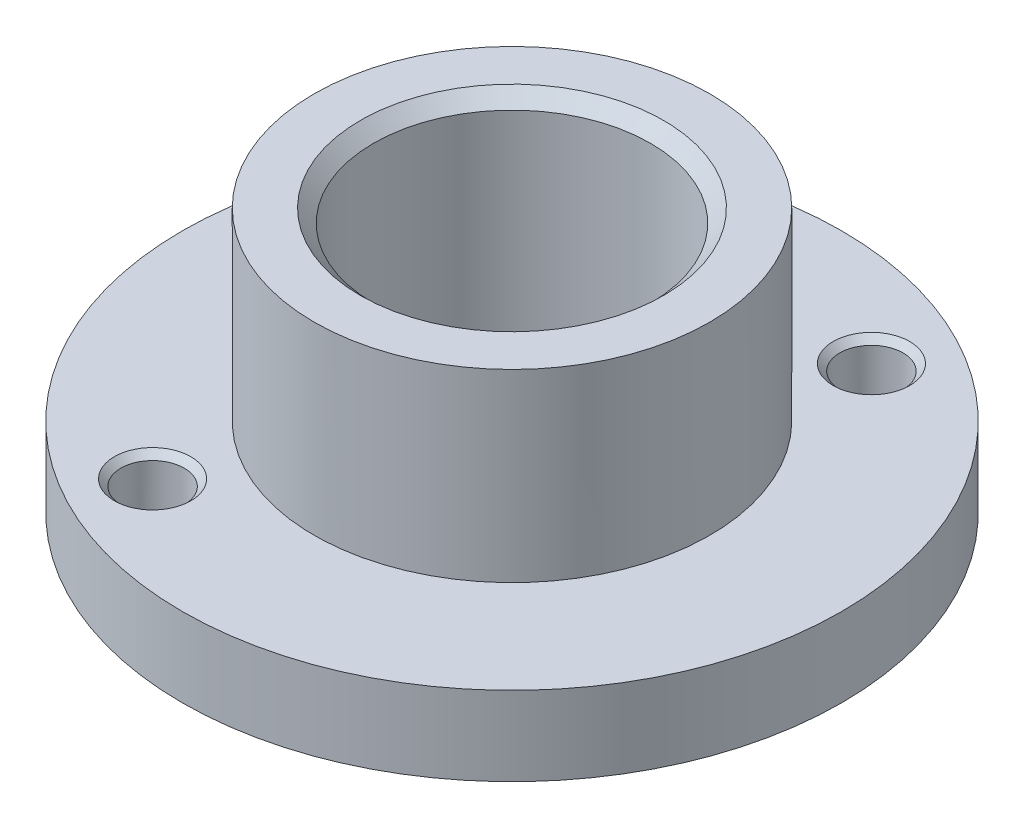
ISO-10303-21;
HEADER;
FILE_DESCRIPTION(('STEP AP214'),'2;1');
FILE_NAME('part.step','',(''),(''),'','','');
FILE_SCHEMA(('AUTOMOTIVE_DESIGN { 1 0 10303 214 1 1 1 1 }'));
ENDSEC;
DATA;
#1=APPLICATION_CONTEXT('core data for automotive mechanical design processes');
#2=APPLICATION_PROTOCOL_DEFINITION('international standard','automotive_design',2000,#1);
#3=PRODUCT_CONTEXT('',#1,'mechanical');
#4=PRODUCT('Part','Part','',(#3));
#5=PRODUCT_RELATED_PRODUCT_CATEGORY('part','',(#4));
#6=PRODUCT_DEFINITION_FORMATION('','',#4);
#7=PRODUCT_DEFINITION_CONTEXT('part definition',#1,'design');
#8=PRODUCT_DEFINITION('design','',#6,#7);
#9=PRODUCT_DEFINITION_SHAPE('','',#8);
#10=(LENGTH_UNIT() NAMED_UNIT(*) SI_UNIT(.MILLI.,.METRE.));
#11=(NAMED_UNIT(*) PLANE_ANGLE_UNIT() SI_UNIT($,.RADIAN.));
#12=(NAMED_UNIT(*) SI_UNIT($,.STERADIAN.) SOLID_ANGLE_UNIT());
#13=UNCERTAINTY_MEASURE_WITH_UNIT(LENGTH_MEASURE(1.E-05),#10,'distance_accuracy_value','');
#14=(GEOMETRIC_REPRESENTATION_CONTEXT(3) GLOBAL_UNCERTAINTY_ASSIGNED_CONTEXT((#13)) GLOBAL_UNIT_ASSIGNED_CONTEXT((#10,
#11,#12)) REPRESENTATION_CONTEXT('',''));
#15=CARTESIAN_POINT('',(0.,0.,0.));
#16=DIRECTION('',(0.,0.,1.));
#17=DIRECTION('',(1.,0.,0.));
#18=AXIS2_PLACEMENT_3D('',#15,#16,#17);
#19=CARTESIAN_POINT('',(0.,10.,0.));
#20=DIRECTION('',(0.,-1.,0.));
#21=DIRECTION('',(0.,0.,-1.));
#22=AXIS2_PLACEMENT_3D('',#19,#20,#21);
#23=CYLINDRICAL_SURFACE('',#22,7.5);
#24=CARTESIAN_POINT('',(0.,10.,0.));
#25=DIRECTION('',(0.,1.,0.));
#26=DIRECTION('',(0.,0.,1.));
#27=AXIS2_PLACEMENT_3D('',#24,#25,#26);
#28=CIRCLE('',#27,7.5);
#29=CARTESIAN_POINT('',(0.,10.,7.5));
#30=VERTEX_POINT('',#29);
#31=EDGE_CURVE('E66',#30,#30,#28,.T.);
#32=ORIENTED_EDGE('',*,*,#31,.F.);
#33=EDGE_LOOP('',(#32));
#34=FACE_BOUND('',#33,.T.);
#35=CARTESIAN_POINT('',(0.,3.,0.));
#36=DIRECTION('',(0.,-1.,0.));
#37=DIRECTION('',(0.,0.,-1.));
#38=AXIS2_PLACEMENT_3D('',#35,#36,#37);
#39=CIRCLE('',#38,7.5);
#40=CARTESIAN_POINT('',(0.,3.,-7.5));
#41=VERTEX_POINT('',#40);
#42=EDGE_CURVE('E63',#41,#41,#39,.T.);
#43=ORIENTED_EDGE('',*,*,#42,.F.);
#44=EDGE_LOOP('',(#43));
#45=FACE_BOUND('',#44,.T.);
#46=ADVANCED_FACE('F31',(#34,#45),#23,.T.);
#47=CARTESIAN_POINT('',(0.,10.,0.));
#48=DIRECTION('',(0.,1.,0.));
#49=DIRECTION('',(0.,0.,1.));
#50=AXIS2_PLACEMENT_3D('',#47,#48,#49);
#51=PLANE('',#50);
#52=CARTESIAN_POINT('',(0.,10.,0.));
#53=DIRECTION('',(0.,1.,0.));
#54=DIRECTION('',(0.,0.,1.));
#55=AXIS2_PLACEMENT_3D('',#52,#53,#54);
#56=CIRCLE('',#55,5.75000000000001);
#57=CARTESIAN_POINT('',(0.,10.,5.75000000000001));
#58=VERTEX_POINT('',#57);
#59=EDGE_CURVE('E57',#58,#58,#56,.F.);
#60=ORIENTED_EDGE('',*,*,#59,.T.);
#61=EDGE_LOOP('',(#60));
#62=FACE_BOUND('',#61,.T.);
#63=ORIENTED_EDGE('',*,*,#31,.T.);
#64=EDGE_LOOP('',(#63));
#65=FACE_BOUND('',#64,.T.);
#66=ADVANCED_FACE('F108',(#62,#65),#51,.T.);
#67=CARTESIAN_POINT('',(0.,0.,0.));
#68=DIRECTION('',(0.,1.,0.));
#69=DIRECTION('',(0.,0.,1.));
#70=AXIS2_PLACEMENT_3D('',#67,#68,#69);
#71=PLANE('',#70);
#72=CARTESIAN_POINT('',(4.92205180239147,0.,-8.704792131612));
#73=DIRECTION('',(0.,1.,0.));
#74=DIRECTION('',(0.,0.,1.));
#75=AXIS2_PLACEMENT_3D('',#72,#73,#74);
#76=CIRCLE('',#75,1.19999999999999);
#77=CARTESIAN_POINT('',(4.92205180239147,0.,-7.50479213161201));
#78=VERTEX_POINT('',#77);
#79=EDGE_CURVE('E84',#78,#78,#76,.T.);
#80=ORIENTED_EDGE('',*,*,#79,.T.);
#81=EDGE_LOOP('',(#80));
#82=FACE_BOUND('',#81,.T.);
#83=CARTESIAN_POINT('',(-4.92205180239138,0.,8.70479213161213));
#84=DIRECTION('',(0.,1.,0.));
#85=DIRECTION('',(0.,0.,1.));
#86=AXIS2_PLACEMENT_3D('',#83,#84,#85);
#87=CIRCLE('',#86,1.19999999999999);
#88=CARTESIAN_POINT('',(-4.92205180239138,0.,9.90479213161212));
#89=VERTEX_POINT('',#88);
#90=EDGE_CURVE('E81',#89,#89,#87,.T.);
#91=ORIENTED_EDGE('',*,*,#90,.T.);
#92=EDGE_LOOP('',(#91));
#93=FACE_BOUND('',#92,.T.);
#94=CARTESIAN_POINT('',(-8.70479213161203,0.,-4.92205180239135));
#95=DIRECTION('',(0.,1.,0.));
#96=DIRECTION('',(0.,0.,1.));
#97=AXIS2_PLACEMENT_3D('',#94,#95,#96);
#98=CIRCLE('',#97,1.19999999999999);
#99=CARTESIAN_POINT('',(-8.70479213161203,0.,-3.72205180239137));
#100=VERTEX_POINT('',#99);
#101=EDGE_CURVE('E76',#100,#100,#98,.T.);
#102=ORIENTED_EDGE('',*,*,#101,.T.);
#103=EDGE_LOOP('',(#102));
#104=FACE_BOUND('',#103,.T.);
#105=CARTESIAN_POINT('',(0.,0.,0.));
#106=DIRECTION('',(0.,1.,0.));
#107=DIRECTION('',(0.,0.,1.));
#108=AXIS2_PLACEMENT_3D('',#105,#106,#107);
#109=CIRCLE('',#108,5.25);
#110=CARTESIAN_POINT('',(0.,0.,5.25));
#111=VERTEX_POINT('',#110);
#112=EDGE_CURVE('E69',#111,#111,#109,.T.);
#113=ORIENTED_EDGE('',*,*,#112,.T.);
#114=EDGE_LOOP('',(#113));
#115=FACE_BOUND('',#114,.T.);
#116=CARTESIAN_POINT('',(0.,0.,0.));
#117=DIRECTION('',(0.,-1.,0.));
#118=DIRECTION('',(0.,0.,-1.));
#119=AXIS2_PLACEMENT_3D('',#116,#117,#118);
#120=CIRCLE('',#119,12.5);
#121=CARTESIAN_POINT('',(0.,0.,-12.5));
#122=VERTEX_POINT('',#121);
#123=EDGE_CURVE('E73',#122,#122,#120,.T.);
#124=ORIENTED_EDGE('',*,*,#123,.T.);
#125=EDGE_LOOP('',(#124));
#126=FACE_BOUND('',#125,.T.);
#127=ADVANCED_FACE('F88',(#82,#93,#104,#115,#126),#71,.F.);
#128=CARTESIAN_POINT('',(0.,10.,0.));
#129=DIRECTION('',(0.,-1.,0.));
#130=DIRECTION('',(0.,0.,-1.));
#131=AXIS2_PLACEMENT_3D('',#128,#129,#130);
#132=CYLINDRICAL_SURFACE('',#131,5.25);
#133=CARTESIAN_POINT('',(0.,9.49999999999999,0.));
#134=DIRECTION('',(0.,1.,0.));
#135=DIRECTION('',(0.,0.,1.));
#136=AXIS2_PLACEMENT_3D('',#133,#134,#135);
#137=CIRCLE('',#136,5.25);
#138=CARTESIAN_POINT('',(0.,9.49999999999999,5.25));
#139=VERTEX_POINT('',#138);
#140=EDGE_CURVE('E60',#139,#139,#137,.T.);
#141=ORIENTED_EDGE('',*,*,#140,.T.);
#142=EDGE_LOOP('',(#141));
#143=FACE_BOUND('',#142,.T.);
#144=ORIENTED_EDGE('',*,*,#112,.F.);
#145=EDGE_LOOP('',(#144));
#146=FACE_BOUND('',#145,.T.);
#147=ADVANCED_FACE('F147',(#143,#146),#132,.F.);
#148=CARTESIAN_POINT('',(0.,3.,0.));
#149=DIRECTION('',(0.,-1.,0.));
#150=DIRECTION('',(0.,0.,-1.));
#151=AXIS2_PLACEMENT_3D('',#148,#149,#150);
#152=CYLINDRICAL_SURFACE('',#151,12.5);
#153=CARTESIAN_POINT('',(0.,3.,0.));
#154=DIRECTION('',(0.,-1.,0.));
#155=DIRECTION('',(0.,0.,-1.));
#156=AXIS2_PLACEMENT_3D('',#153,#154,#155);
#157=CIRCLE('',#156,12.5);
#158=CARTESIAN_POINT('',(0.,3.,-12.5));
#159=VERTEX_POINT('',#158);
#160=EDGE_CURVE('E72',#159,#159,#157,.T.);
#161=ORIENTED_EDGE('',*,*,#160,.T.);
#162=EDGE_LOOP('',(#161));
#163=FACE_BOUND('',#162,.T.);
#164=ORIENTED_EDGE('',*,*,#123,.F.);
#165=EDGE_LOOP('',(#164));
#166=FACE_BOUND('',#165,.T.);
#167=ADVANCED_FACE('F136',(#163,#166),#152,.T.);
#168=CARTESIAN_POINT('',(0.,3.,0.));
#169=DIRECTION('',(0.,-1.,0.));
#170=DIRECTION('',(0.,0.,-1.));
#171=AXIS2_PLACEMENT_3D('',#168,#169,#170);
#172=PLANE('',#171);
#173=CARTESIAN_POINT('',(4.92205180239147,3.,-8.704792131612));
#174=DIRECTION('',(0.,-1.,0.));
#175=DIRECTION('',(0.,0.,-1.));
#176=AXIS2_PLACEMENT_3D('',#173,#174,#175);
#177=CIRCLE('',#176,1.44999999999999);
#178=CARTESIAN_POINT('',(4.92205180239147,3.,-10.154792131612));
#179=VERTEX_POINT('',#178);
#180=EDGE_CURVE('E42',#179,#179,#177,.T.);
#181=ORIENTED_EDGE('',*,*,#180,.T.);
#182=EDGE_LOOP('',(#181));
#183=FACE_BOUND('',#182,.T.);
#184=CARTESIAN_POINT('',(-4.92205180239138,3.,8.70479213161213));
#185=DIRECTION('',(0.,-1.,0.));
#186=DIRECTION('',(0.,0.,-1.));
#187=AXIS2_PLACEMENT_3D('',#184,#185,#186);
#188=CIRCLE('',#187,1.44999999999999);
#189=CARTESIAN_POINT('',(-4.92205180239138,3.,7.25479213161214));
#190=VERTEX_POINT('',#189);
#191=EDGE_CURVE('E46',#190,#190,#188,.T.);
#192=ORIENTED_EDGE('',*,*,#191,.T.);
#193=EDGE_LOOP('',(#192));
#194=FACE_BOUND('',#193,.T.);
#195=CARTESIAN_POINT('',(-8.70479213161203,3.,-4.92205180239135));
#196=DIRECTION('',(0.,-1.,0.));
#197=DIRECTION('',(0.,0.,-1.));
#198=AXIS2_PLACEMENT_3D('',#195,#196,#197);
#199=CIRCLE('',#198,1.44999999999999);
#200=CARTESIAN_POINT('',(-8.70479213161203,3.,-6.37205180239134));
#201=VERTEX_POINT('',#200);
#202=EDGE_CURVE('E51',#201,#201,#199,.T.);
#203=ORIENTED_EDGE('',*,*,#202,.T.);
#204=EDGE_LOOP('',(#203));
#205=FACE_BOUND('',#204,.T.);
#206=ORIENTED_EDGE('',*,*,#42,.T.);
#207=EDGE_LOOP('',(#206));
#208=FACE_BOUND('',#207,.T.);
#209=ORIENTED_EDGE('',*,*,#160,.F.);
#210=EDGE_LOOP('',(#209));
#211=FACE_BOUND('',#210,.T.);
#212=ADVANCED_FACE('F133',(#183,#194,#205,#208,#211),#172,.F.);
#213=CARTESIAN_POINT('',(-8.70479213161203,3.,-4.92205180239135));
#214=DIRECTION('',(0.,1.,0.));
#215=DIRECTION('',(0.,0.,1.));
#216=AXIS2_PLACEMENT_3D('',#213,#214,#215);
#217=CYLINDRICAL_SURFACE('',#216,1.19999999999999);
#218=CARTESIAN_POINT('',(-8.70479213161203,2.75,-4.92205180239135));
#219=DIRECTION('',(0.,-1.,0.));
#220=DIRECTION('',(0.,0.,-1.));
#221=AXIS2_PLACEMENT_3D('',#218,#219,#220);
#222=CIRCLE('',#221,1.19999999999999);
#223=CARTESIAN_POINT('',(-8.70479213161203,2.75,-6.12205180239134));
#224=VERTEX_POINT('',#223);
#225=EDGE_CURVE('E10',#224,#224,#222,.F.);
#226=ORIENTED_EDGE('',*,*,#225,.T.);
#227=EDGE_LOOP('',(#226));
#228=FACE_BOUND('',#227,.T.);
#229=ORIENTED_EDGE('',*,*,#101,.F.);
#230=EDGE_LOOP('',(#229));
#231=FACE_BOUND('',#230,.T.);
#232=ADVANCED_FACE('F105',(#228,#231),#217,.F.);
#233=CARTESIAN_POINT('',(-4.92205180239138,3.,8.70479213161213));
#234=DIRECTION('',(0.,1.,0.));
#235=DIRECTION('',(0.,0.,1.));
#236=AXIS2_PLACEMENT_3D('',#233,#234,#235);
#237=CYLINDRICAL_SURFACE('',#236,1.19999999999999);
#238=CARTESIAN_POINT('',(-4.92205180239138,2.75,8.70479213161213));
#239=DIRECTION('',(0.,-1.,0.));
#240=DIRECTION('',(0.,0.,-1.));
#241=AXIS2_PLACEMENT_3D('',#238,#239,#240);
#242=CIRCLE('',#241,1.19999999999999);
#243=CARTESIAN_POINT('',(-4.92205180239138,2.75,7.50479213161215));
#244=VERTEX_POINT('',#243);
#245=EDGE_CURVE('E38',#244,#244,#242,.F.);
#246=ORIENTED_EDGE('',*,*,#245,.T.);
#247=EDGE_LOOP('',(#246));
#248=FACE_BOUND('',#247,.T.);
#249=ORIENTED_EDGE('',*,*,#90,.F.);
#250=EDGE_LOOP('',(#249));
#251=FACE_BOUND('',#250,.T.);
#252=ADVANCED_FACE('F94',(#248,#251),#237,.F.);
#253=CARTESIAN_POINT('',(4.92205180239147,3.,-8.704792131612));
#254=DIRECTION('',(0.,1.,0.));
#255=DIRECTION('',(0.,0.,1.));
#256=AXIS2_PLACEMENT_3D('',#253,#254,#255);
#257=CYLINDRICAL_SURFACE('',#256,1.19999999999999);
#258=CARTESIAN_POINT('',(4.92205180239147,2.75,-8.704792131612));
#259=DIRECTION('',(0.,-1.,0.));
#260=DIRECTION('',(0.,0.,-1.));
#261=AXIS2_PLACEMENT_3D('',#258,#259,#260);
#262=CIRCLE('',#261,1.19999999999999);
#263=CARTESIAN_POINT('',(4.92205180239147,2.75,-9.90479213161199));
#264=VERTEX_POINT('',#263);
#265=EDGE_CURVE('E54',#264,#264,#262,.F.);
#266=ORIENTED_EDGE('',*,*,#265,.T.);
#267=EDGE_LOOP('',(#266));
#268=FACE_BOUND('',#267,.T.);
#269=ORIENTED_EDGE('',*,*,#79,.F.);
#270=EDGE_LOOP('',(#269));
#271=FACE_BOUND('',#270,.T.);
#272=ADVANCED_FACE('F91',(#268,#271),#257,.F.);
#273=CARTESIAN_POINT('',(0.,9.49999999999999,0.));
#274=DIRECTION('',(0.,1.,0.));
#275=DIRECTION('',(0.,0.,1.));
#276=AXIS2_PLACEMENT_3D('',#273,#274,#275);
#277=CONICAL_SURFACE('',#276,5.25,0.785398163397446);
#278=ORIENTED_EDGE('',*,*,#59,.F.);
#279=EDGE_LOOP('',(#278));
#280=FACE_BOUND('',#279,.T.);
#281=ORIENTED_EDGE('',*,*,#140,.F.);
#282=EDGE_LOOP('',(#281));
#283=FACE_BOUND('',#282,.T.);
#284=ADVANCED_FACE('F93',(#280,#283),#277,.F.);
#285=CARTESIAN_POINT('',(4.92205180239147,2.75,-8.704792131612));
#286=DIRECTION('',(0.,1.,0.));
#287=DIRECTION('',(0.,0.,1.));
#288=AXIS2_PLACEMENT_3D('',#285,#286,#287);
#289=CONICAL_SURFACE('',#288,1.19999999999999,0.785398163397447);
#290=ORIENTED_EDGE('',*,*,#180,.F.);
#291=EDGE_LOOP('',(#290));
#292=FACE_BOUND('',#291,.T.);
#293=ORIENTED_EDGE('',*,*,#265,.F.);
#294=EDGE_LOOP('',(#293));
#295=FACE_BOUND('',#294,.T.);
#296=ADVANCED_FACE('F102',(#292,#295),#289,.F.);
#297=CARTESIAN_POINT('',(-4.92205180239138,2.75,8.70479213161213));
#298=DIRECTION('',(0.,1.,0.));
#299=DIRECTION('',(0.,0.,1.));
#300=AXIS2_PLACEMENT_3D('',#297,#298,#299);
#301=CONICAL_SURFACE('',#300,1.19999999999999,0.785398163397447);
#302=ORIENTED_EDGE('',*,*,#191,.F.);
#303=EDGE_LOOP('',(#302));
#304=FACE_BOUND('',#303,.T.);
#305=ORIENTED_EDGE('',*,*,#245,.F.);
#306=EDGE_LOOP('',(#305));
#307=FACE_BOUND('',#306,.T.);
#308=ADVANCED_FACE('F122',(#304,#307),#301,.F.);
#309=CARTESIAN_POINT('',(-8.70479213161203,2.75,-4.92205180239135));
#310=DIRECTION('',(0.,1.,0.));
#311=DIRECTION('',(0.,0.,1.));
#312=AXIS2_PLACEMENT_3D('',#309,#310,#311);
#313=CONICAL_SURFACE('',#312,1.19999999999999,0.785398163397447);
#314=ORIENTED_EDGE('',*,*,#202,.F.);
#315=EDGE_LOOP('',(#314));
#316=FACE_BOUND('',#315,.T.);
#317=ORIENTED_EDGE('',*,*,#225,.F.);
#318=EDGE_LOOP('',(#317));
#319=FACE_BOUND('',#318,.T.);
#320=ADVANCED_FACE('F33',(#316,#319),#313,.F.);
#321=CLOSED_SHELL('',(#46,#66,#127,#147,#167,#212,#232,#252,#272,#284,#296,#308,#320));
#322=MANIFOLD_SOLID_BREP('B2',#321);
#323=ADVANCED_BREP_SHAPE_REPRESENTATION('',(#18,#322),#14);
#324=SHAPE_DEFINITION_REPRESENTATION(#9,#323);
ENDSEC;
END-ISO-10303-21;
